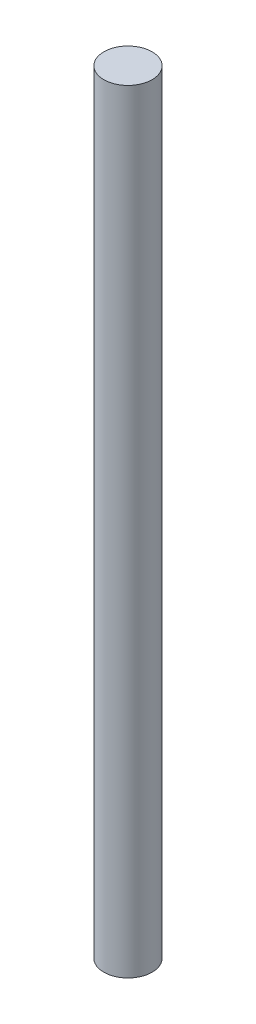
ISO-10303-21;
HEADER;
FILE_DESCRIPTION(('STEP AP214'),'2;1');
FILE_NAME('part.step','',(''),(''),'','','');
FILE_SCHEMA(('AUTOMOTIVE_DESIGN { 1 0 10303 214 1 1 1 1 }'));
ENDSEC;
DATA;
#1=APPLICATION_CONTEXT('core data for automotive mechanical design processes');
#2=APPLICATION_PROTOCOL_DEFINITION('international standard','automotive_design',2000,#1);
#3=PRODUCT_CONTEXT('',#1,'mechanical');
#4=PRODUCT('Part','Part','',(#3));
#5=PRODUCT_RELATED_PRODUCT_CATEGORY('part','',(#4));
#6=PRODUCT_DEFINITION_FORMATION('','',#4);
#7=PRODUCT_DEFINITION_CONTEXT('part definition',#1,'design');
#8=PRODUCT_DEFINITION('design','',#6,#7);
#9=PRODUCT_DEFINITION_SHAPE('','',#8);
#10=(LENGTH_UNIT() NAMED_UNIT(*) SI_UNIT(.MILLI.,.METRE.));
#11=(NAMED_UNIT(*) PLANE_ANGLE_UNIT() SI_UNIT($,.RADIAN.));
#12=(NAMED_UNIT(*) SI_UNIT($,.STERADIAN.) SOLID_ANGLE_UNIT());
#13=UNCERTAINTY_MEASURE_WITH_UNIT(LENGTH_MEASURE(1.E-05),#10,'distance_accuracy_value','');
#14=(GEOMETRIC_REPRESENTATION_CONTEXT(3) GLOBAL_UNCERTAINTY_ASSIGNED_CONTEXT((#13)) GLOBAL_UNIT_ASSIGNED_CONTEXT((#10,
#11,#12)) REPRESENTATION_CONTEXT('',''));
#15=CARTESIAN_POINT('',(0.,0.,0.));
#16=DIRECTION('',(0.,0.,1.));
#17=DIRECTION('',(1.,0.,0.));
#18=AXIS2_PLACEMENT_3D('',#15,#16,#17);
#19=CARTESIAN_POINT('',(0.,254.,0.));
#20=DIRECTION('',(0.,-1.,0.));
#21=DIRECTION('',(0.,0.,-1.));
#22=AXIS2_PLACEMENT_3D('',#19,#20,#21);
#23=CYLINDRICAL_SURFACE('',#22,7.9375);
#24=CARTESIAN_POINT('',(0.,254.,0.));
#25=DIRECTION('',(0.,1.,0.));
#26=DIRECTION('',(0.,0.,1.));
#27=AXIS2_PLACEMENT_3D('',#24,#25,#26);
#28=CIRCLE('',#27,7.9375);
#29=CARTESIAN_POINT('',(0.,254.,7.9375));
#30=VERTEX_POINT('',#29);
#31=EDGE_CURVE('E10',#30,#30,#28,.T.);
#32=ORIENTED_EDGE('',*,*,#31,.F.);
#33=EDGE_LOOP('',(#32));
#34=FACE_BOUND('',#33,.T.);
#35=CARTESIAN_POINT('',(0.,0.,0.));
#36=DIRECTION('',(0.,1.,0.));
#37=DIRECTION('',(0.,0.,1.));
#38=AXIS2_PLACEMENT_3D('',#35,#36,#37);
#39=CIRCLE('',#38,7.9375);
#40=CARTESIAN_POINT('',(0.,0.,7.9375));
#41=VERTEX_POINT('',#40);
#42=EDGE_CURVE('E34',#41,#41,#39,.T.);
#43=ORIENTED_EDGE('',*,*,#42,.T.);
#44=EDGE_LOOP('',(#43));
#45=FACE_BOUND('',#44,.T.);
#46=ADVANCED_FACE('F31',(#34,#45),#23,.T.);
#47=CARTESIAN_POINT('',(0.,254.,0.));
#48=DIRECTION('',(0.,1.,0.));
#49=DIRECTION('',(0.,0.,1.));
#50=AXIS2_PLACEMENT_3D('',#47,#48,#49);
#51=PLANE('',#50);
#52=ORIENTED_EDGE('',*,*,#31,.T.);
#53=EDGE_LOOP('',(#52));
#54=FACE_BOUND('',#53,.T.);
#55=ADVANCED_FACE('F46',(#54),#51,.T.);
#56=CARTESIAN_POINT('',(0.,0.,0.));
#57=DIRECTION('',(0.,1.,0.));
#58=DIRECTION('',(0.,0.,1.));
#59=AXIS2_PLACEMENT_3D('',#56,#57,#58);
#60=PLANE('',#59);
#61=ORIENTED_EDGE('',*,*,#42,.F.);
#62=EDGE_LOOP('',(#61));
#63=FACE_BOUND('',#62,.T.);
#64=ADVANCED_FACE('F44',(#63),#60,.F.);
#65=CLOSED_SHELL('',(#46,#55,#64));
#66=MANIFOLD_SOLID_BREP('B2',#65);
#67=ADVANCED_BREP_SHAPE_REPRESENTATION('',(#18,#66),#14);
#68=SHAPE_DEFINITION_REPRESENTATION(#9,#67);
ENDSEC;
END-ISO-10303-21;
